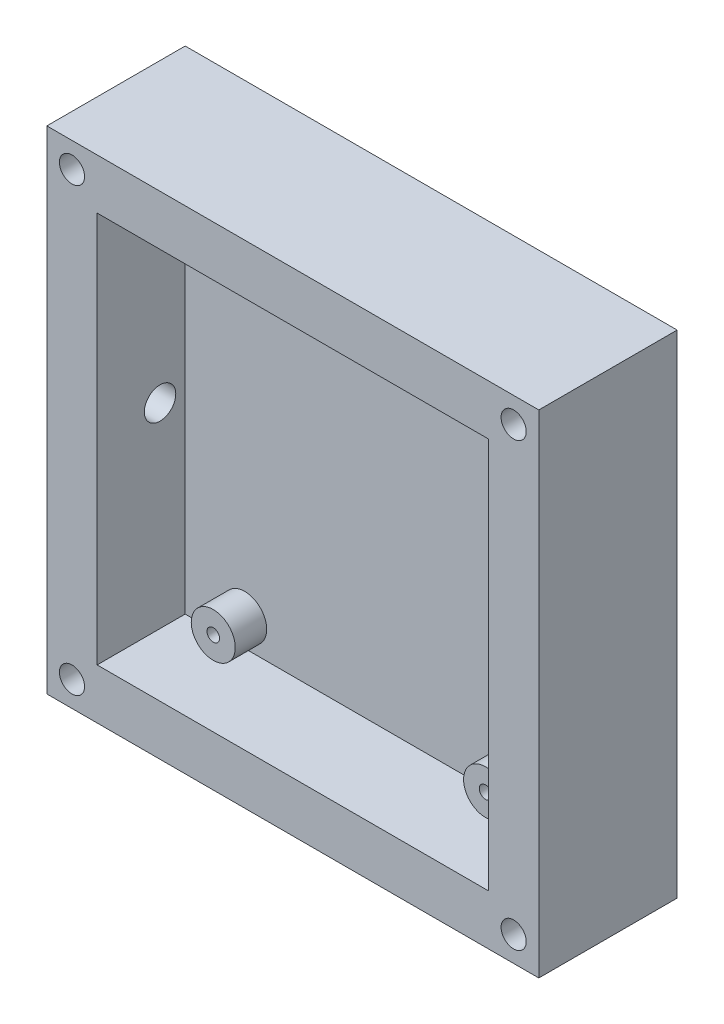
ISO-10303-21;
HEADER;
FILE_DESCRIPTION(('STEP AP214'),'2;1');
FILE_NAME('part.step','',(''),(''),'','','');
FILE_SCHEMA(('AUTOMOTIVE_DESIGN { 1 0 10303 214 1 1 1 1 }'));
ENDSEC;
DATA;
#1=APPLICATION_CONTEXT('core data for automotive mechanical design processes');
#2=APPLICATION_PROTOCOL_DEFINITION('international standard','automotive_design',2000,#1);
#3=PRODUCT_CONTEXT('',#1,'mechanical');
#4=PRODUCT('Part','Part','',(#3));
#5=PRODUCT_RELATED_PRODUCT_CATEGORY('part','',(#4));
#6=PRODUCT_DEFINITION_FORMATION('','',#4);
#7=PRODUCT_DEFINITION_CONTEXT('part definition',#1,'design');
#8=PRODUCT_DEFINITION('design','',#6,#7);
#9=PRODUCT_DEFINITION_SHAPE('','',#8);
#10=(LENGTH_UNIT() NAMED_UNIT(*) SI_UNIT(.MILLI.,.METRE.));
#11=(NAMED_UNIT(*) PLANE_ANGLE_UNIT() SI_UNIT($,.RADIAN.));
#12=(NAMED_UNIT(*) SI_UNIT($,.STERADIAN.) SOLID_ANGLE_UNIT());
#13=UNCERTAINTY_MEASURE_WITH_UNIT(LENGTH_MEASURE(1.E-05),#10,'distance_accuracy_value','');
#14=(GEOMETRIC_REPRESENTATION_CONTEXT(3) GLOBAL_UNCERTAINTY_ASSIGNED_CONTEXT((#13)) GLOBAL_UNIT_ASSIGNED_CONTEXT((#10,
#11,#12)) REPRESENTATION_CONTEXT('',''));
#15=CARTESIAN_POINT('',(0.,0.,0.));
#16=DIRECTION('',(0.,0.,1.));
#17=DIRECTION('',(1.,0.,0.));
#18=AXIS2_PLACEMENT_3D('',#15,#16,#17);
#19=CARTESIAN_POINT('',(39.11,39.11,22.));
#20=DIRECTION('',(-1.,0.,0.));
#21=DIRECTION('',(0.,0.,1.));
#22=AXIS2_PLACEMENT_3D('',#19,#20,#21);
#23=PLANE('',#22);
#24=DIRECTION('',(0.,1.,0.));
#25=VECTOR('',#24,1.);
#26=CARTESIAN_POINT('',(39.11,39.11,0.));
#27=LINE('',#26,#25);
#28=CARTESIAN_POINT('',(39.11,-39.11,0.));
#29=VERTEX_POINT('',#28);
#30=CARTESIAN_POINT('',(39.11,39.11,0.));
#31=VERTEX_POINT('',#30);
#32=EDGE_CURVE('E155',#29,#31,#27,.T.);
#33=ORIENTED_EDGE('',*,*,#32,.T.);
#34=DIRECTION('',(0.,0.,-1.));
#35=VECTOR('',#34,1.);
#36=CARTESIAN_POINT('',(39.11,39.11,22.));
#37=LINE('',#36,#35);
#38=CARTESIAN_POINT('',(39.11,39.11,22.));
#39=VERTEX_POINT('',#38);
#40=EDGE_CURVE('E169',#39,#31,#37,.T.);
#41=ORIENTED_EDGE('',*,*,#40,.F.);
#42=DIRECTION('',(0.,1.,0.));
#43=VECTOR('',#42,1.);
#44=CARTESIAN_POINT('',(39.11,39.11,22.));
#45=LINE('',#44,#43);
#46=CARTESIAN_POINT('',(39.11,-39.11,22.));
#47=VERTEX_POINT('',#46);
#48=EDGE_CURVE('E148',#47,#39,#45,.T.);
#49=ORIENTED_EDGE('',*,*,#48,.F.);
#50=DIRECTION('',(0.,0.,-1.));
#51=VECTOR('',#50,1.);
#52=CARTESIAN_POINT('',(39.11,-39.11,22.));
#53=LINE('',#52,#51);
#54=EDGE_CURVE('E154',#47,#29,#53,.T.);
#55=ORIENTED_EDGE('',*,*,#54,.T.);
#56=EDGE_LOOP('',(#33,#41,#49,#55));
#57=FACE_BOUND('',#56,.T.);
#58=ADVANCED_FACE('F39',(#57),#23,.F.);
#59=CARTESIAN_POINT('',(-39.11,39.11,22.));
#60=DIRECTION('',(0.,-1.,0.));
#61=DIRECTION('',(0.,0.,-1.));
#62=AXIS2_PLACEMENT_3D('',#59,#60,#61);
#63=PLANE('',#62);
#64=DIRECTION('',(-1.,0.,0.));
#65=VECTOR('',#64,1.);
#66=CARTESIAN_POINT('',(-39.11,39.11,0.));
#67=LINE('',#66,#65);
#68=CARTESIAN_POINT('',(-39.11,39.11,0.));
#69=VERTEX_POINT('',#68);
#70=EDGE_CURVE('E158',#31,#69,#67,.T.);
#71=ORIENTED_EDGE('',*,*,#70,.T.);
#72=DIRECTION('',(0.,0.,-1.));
#73=VECTOR('',#72,1.);
#74=CARTESIAN_POINT('',(-39.11,39.11,22.));
#75=LINE('',#74,#73);
#76=CARTESIAN_POINT('',(-39.11,39.11,22.));
#77=VERTEX_POINT('',#76);
#78=EDGE_CURVE('E166',#77,#69,#75,.T.);
#79=ORIENTED_EDGE('',*,*,#78,.F.);
#80=DIRECTION('',(-1.,0.,0.));
#81=VECTOR('',#80,1.);
#82=CARTESIAN_POINT('',(-39.11,39.11,22.));
#83=LINE('',#82,#81);
#84=EDGE_CURVE('E92',#39,#77,#83,.T.);
#85=ORIENTED_EDGE('',*,*,#84,.F.);
#86=ORIENTED_EDGE('',*,*,#40,.T.);
#87=EDGE_LOOP('',(#71,#79,#85,#86));
#88=FACE_BOUND('',#87,.T.);
#89=ADVANCED_FACE('F195',(#88),#63,.F.);
#90=CARTESIAN_POINT('',(-39.11,39.11,22.));
#91=DIRECTION('',(1.,0.,0.));
#92=DIRECTION('',(0.,0.,-1.));
#93=AXIS2_PLACEMENT_3D('',#90,#91,#92);
#94=PLANE('',#93);
#95=CARTESIAN_POINT('',(-39.11,-0.040287358321679,12.));
#96=DIRECTION('',(-1.,0.,0.));
#97=DIRECTION('',(0.,-1.,0.));
#98=AXIS2_PLACEMENT_3D('',#95,#96,#97);
#99=CIRCLE('',#98,2.5);
#100=CARTESIAN_POINT('',(-39.11,-2.54028735832168,12.));
#101=VERTEX_POINT('',#100);
#102=EDGE_CURVE('E232',#101,#101,#99,.T.);
#103=ORIENTED_EDGE('',*,*,#102,.F.);
#104=EDGE_LOOP('',(#103));
#105=FACE_BOUND('',#104,.T.);
#106=DIRECTION('',(0.,-1.,0.));
#107=VECTOR('',#106,1.);
#108=CARTESIAN_POINT('',(-39.11,39.11,0.));
#109=LINE('',#108,#107);
#110=CARTESIAN_POINT('',(-39.11,-39.11,0.));
#111=VERTEX_POINT('',#110);
#112=EDGE_CURVE('E160',#69,#111,#109,.T.);
#113=ORIENTED_EDGE('',*,*,#112,.T.);
#114=DIRECTION('',(0.,0.,-1.));
#115=VECTOR('',#114,1.);
#116=CARTESIAN_POINT('',(-39.11,-39.11,22.));
#117=LINE('',#116,#115);
#118=CARTESIAN_POINT('',(-39.11,-39.11,22.));
#119=VERTEX_POINT('',#118);
#120=EDGE_CURVE('E164',#119,#111,#117,.T.);
#121=ORIENTED_EDGE('',*,*,#120,.F.);
#122=DIRECTION('',(0.,-1.,0.));
#123=VECTOR('',#122,1.);
#124=CARTESIAN_POINT('',(-39.11,39.11,22.));
#125=LINE('',#124,#123);
#126=EDGE_CURVE('E151',#77,#119,#125,.T.);
#127=ORIENTED_EDGE('',*,*,#126,.F.);
#128=ORIENTED_EDGE('',*,*,#78,.T.);
#129=EDGE_LOOP('',(#113,#121,#127,#128));
#130=FACE_BOUND('',#129,.T.);
#131=ADVANCED_FACE('F200',(#105,#130),#94,.F.);
#132=CARTESIAN_POINT('',(-39.11,-39.11,22.));
#133=DIRECTION('',(0.,1.,0.));
#134=DIRECTION('',(0.,0.,1.));
#135=AXIS2_PLACEMENT_3D('',#132,#133,#134);
#136=PLANE('',#135);
#137=DIRECTION('',(1.,0.,0.));
#138=VECTOR('',#137,1.);
#139=CARTESIAN_POINT('',(-39.11,-39.11,0.));
#140=LINE('',#139,#138);
#141=EDGE_CURVE('E84',#111,#29,#140,.T.);
#142=ORIENTED_EDGE('',*,*,#141,.T.);
#143=ORIENTED_EDGE('',*,*,#54,.F.);
#144=DIRECTION('',(1.,0.,0.));
#145=VECTOR('',#144,1.);
#146=CARTESIAN_POINT('',(-39.11,-39.11,22.));
#147=LINE('',#146,#145);
#148=EDGE_CURVE('E63',#119,#47,#147,.T.);
#149=ORIENTED_EDGE('',*,*,#148,.F.);
#150=ORIENTED_EDGE('',*,*,#120,.T.);
#151=EDGE_LOOP('',(#142,#143,#149,#150));
#152=FACE_BOUND('',#151,.T.);
#153=ADVANCED_FACE('F212',(#152),#136,.F.);
#154=CARTESIAN_POINT('',(0.,0.,22.));
#155=DIRECTION('',(0.,0.,1.));
#156=DIRECTION('',(1.,0.,0.));
#157=AXIS2_PLACEMENT_3D('',#154,#155,#156);
#158=PLANE('',#157);
#159=CARTESIAN_POINT('',(-35.11,-35.11,22.));
#160=DIRECTION('',(0.,0.,1.));
#161=DIRECTION('',(-1.,0.,0.));
#162=AXIS2_PLACEMENT_3D('',#159,#160,#161);
#163=CIRCLE('',#162,2.);
#164=CARTESIAN_POINT('',(-37.11,-35.11,22.));
#165=VERTEX_POINT('',#164);
#166=EDGE_CURVE('E293',#165,#165,#163,.T.);
#167=ORIENTED_EDGE('',*,*,#166,.F.);
#168=EDGE_LOOP('',(#167));
#169=FACE_BOUND('',#168,.T.);
#170=CARTESIAN_POINT('',(35.11,35.11,22.));
#171=DIRECTION('',(0.,0.,1.));
#172=DIRECTION('',(1.,0.,0.));
#173=AXIS2_PLACEMENT_3D('',#170,#171,#172);
#174=CIRCLE('',#173,2.);
#175=CARTESIAN_POINT('',(37.11,35.11,22.));
#176=VERTEX_POINT('',#175);
#177=EDGE_CURVE('E287',#176,#176,#174,.T.);
#178=ORIENTED_EDGE('',*,*,#177,.F.);
#179=EDGE_LOOP('',(#178));
#180=FACE_BOUND('',#179,.T.);
#181=CARTESIAN_POINT('',(35.11,-35.11,22.));
#182=DIRECTION('',(0.,0.,1.));
#183=DIRECTION('',(-1.,0.,0.));
#184=AXIS2_PLACEMENT_3D('',#181,#182,#183);
#185=CIRCLE('',#184,2.);
#186=CARTESIAN_POINT('',(33.11,-35.11,22.));
#187=VERTEX_POINT('',#186);
#188=EDGE_CURVE('E280',#187,#187,#185,.T.);
#189=ORIENTED_EDGE('',*,*,#188,.F.);
#190=EDGE_LOOP('',(#189));
#191=FACE_BOUND('',#190,.T.);
#192=CARTESIAN_POINT('',(-35.11,35.11,22.));
#193=DIRECTION('',(0.,0.,1.));
#194=DIRECTION('',(1.,0.,0.));
#195=AXIS2_PLACEMENT_3D('',#192,#193,#194);
#196=CIRCLE('',#195,2.);
#197=CARTESIAN_POINT('',(-33.11,35.11,22.));
#198=VERTEX_POINT('',#197);
#199=EDGE_CURVE('E283',#198,#198,#196,.T.);
#200=ORIENTED_EDGE('',*,*,#199,.F.);
#201=EDGE_LOOP('',(#200));
#202=FACE_BOUND('',#201,.T.);
#203=DIRECTION('',(0.,1.,0.));
#204=VECTOR('',#203,1.);
#205=CARTESIAN_POINT('',(31.11,39.11,22.));
#206=LINE('',#205,#204);
#207=CARTESIAN_POINT('',(31.11,-31.11,22.));
#208=VERTEX_POINT('',#207);
#209=CARTESIAN_POINT('',(31.11,31.11,22.));
#210=VERTEX_POINT('',#209);
#211=EDGE_CURVE('E137',#208,#210,#206,.T.);
#212=ORIENTED_EDGE('',*,*,#211,.F.);
#213=DIRECTION('',(1.,0.,0.));
#214=VECTOR('',#213,1.);
#215=CARTESIAN_POINT('',(-39.11,-31.11,22.));
#216=LINE('',#215,#214);
#217=CARTESIAN_POINT('',(-31.11,-31.11,22.));
#218=VERTEX_POINT('',#217);
#219=EDGE_CURVE('E146',#218,#208,#216,.T.);
#220=ORIENTED_EDGE('',*,*,#219,.F.);
#221=DIRECTION('',(0.,-1.,0.));
#222=VECTOR('',#221,1.);
#223=CARTESIAN_POINT('',(-31.11,39.11,22.));
#224=LINE('',#223,#222);
#225=CARTESIAN_POINT('',(-31.11,31.11,22.));
#226=VERTEX_POINT('',#225);
#227=EDGE_CURVE('E144',#226,#218,#224,.T.);
#228=ORIENTED_EDGE('',*,*,#227,.F.);
#229=DIRECTION('',(-1.,0.,0.));
#230=VECTOR('',#229,1.);
#231=CARTESIAN_POINT('',(-39.11,31.11,22.));
#232=LINE('',#231,#230);
#233=EDGE_CURVE('E129',#210,#226,#232,.T.);
#234=ORIENTED_EDGE('',*,*,#233,.F.);
#235=EDGE_LOOP('',(#212,#220,#228,#234));
#236=FACE_BOUND('',#235,.T.);
#237=ORIENTED_EDGE('',*,*,#48,.T.);
#238=ORIENTED_EDGE('',*,*,#84,.T.);
#239=ORIENTED_EDGE('',*,*,#126,.T.);
#240=ORIENTED_EDGE('',*,*,#148,.T.);
#241=EDGE_LOOP('',(#237,#238,#239,#240));
#242=FACE_BOUND('',#241,.T.);
#243=ADVANCED_FACE('F210',(#169,#180,#191,#202,#236,#242),#158,.T.);
#244=CARTESIAN_POINT('',(0.,0.,0.));
#245=DIRECTION('',(0.,0.,1.));
#246=DIRECTION('',(1.,0.,0.));
#247=AXIS2_PLACEMENT_3D('',#244,#245,#246);
#248=PLANE('',#247);
#249=ORIENTED_EDGE('',*,*,#32,.F.);
#250=ORIENTED_EDGE('',*,*,#141,.F.);
#251=ORIENTED_EDGE('',*,*,#112,.F.);
#252=ORIENTED_EDGE('',*,*,#70,.F.);
#253=EDGE_LOOP('',(#249,#250,#251,#252));
#254=FACE_BOUND('',#253,.T.);
#255=ADVANCED_FACE('F205',(#254),#248,.F.);
#256=CARTESIAN_POINT('',(31.11,39.11,22.));
#257=DIRECTION('',(-1.,0.,0.));
#258=DIRECTION('',(0.,0.,1.));
#259=AXIS2_PLACEMENT_3D('',#256,#257,#258);
#260=PLANE('',#259);
#261=DIRECTION('',(0.,1.,0.));
#262=VECTOR('',#261,1.);
#263=CARTESIAN_POINT('',(31.11,39.11,8.));
#264=LINE('',#263,#262);
#265=CARTESIAN_POINT('',(31.11,-31.11,8.));
#266=VERTEX_POINT('',#265);
#267=CARTESIAN_POINT('',(31.11,31.11,8.));
#268=VERTEX_POINT('',#267);
#269=EDGE_CURVE('E120',#266,#268,#264,.T.);
#270=ORIENTED_EDGE('',*,*,#269,.F.);
#271=DIRECTION('',(0.,0.,-1.));
#272=VECTOR('',#271,1.);
#273=CARTESIAN_POINT('',(31.11,-31.11,22.));
#274=LINE('',#273,#272);
#275=EDGE_CURVE('E140',#208,#266,#274,.T.);
#276=ORIENTED_EDGE('',*,*,#275,.F.);
#277=ORIENTED_EDGE('',*,*,#211,.T.);
#278=DIRECTION('',(0.,0.,-1.));
#279=VECTOR('',#278,1.);
#280=CARTESIAN_POINT('',(31.11,31.11,22.));
#281=LINE('',#280,#279);
#282=EDGE_CURVE('E132',#210,#268,#281,.T.);
#283=ORIENTED_EDGE('',*,*,#282,.T.);
#284=EDGE_LOOP('',(#270,#276,#277,#283));
#285=FACE_BOUND('',#284,.T.);
#286=ADVANCED_FACE('F217',(#285),#260,.T.);
#287=CARTESIAN_POINT('',(-39.11,31.11,22.));
#288=DIRECTION('',(0.,-1.,0.));
#289=DIRECTION('',(0.,0.,-1.));
#290=AXIS2_PLACEMENT_3D('',#287,#288,#289);
#291=PLANE('',#290);
#292=DIRECTION('',(-1.,0.,0.));
#293=VECTOR('',#292,1.);
#294=CARTESIAN_POINT('',(-39.11,31.11,8.));
#295=LINE('',#294,#293);
#296=CARTESIAN_POINT('',(-31.11,31.11,8.));
#297=VERTEX_POINT('',#296);
#298=EDGE_CURVE('E114',#268,#297,#295,.T.);
#299=ORIENTED_EDGE('',*,*,#298,.F.);
#300=ORIENTED_EDGE('',*,*,#282,.F.);
#301=ORIENTED_EDGE('',*,*,#233,.T.);
#302=DIRECTION('',(0.,0.,-1.));
#303=VECTOR('',#302,1.);
#304=CARTESIAN_POINT('',(-31.11,31.11,22.));
#305=LINE('',#304,#303);
#306=EDGE_CURVE('E126',#226,#297,#305,.T.);
#307=ORIENTED_EDGE('',*,*,#306,.T.);
#308=EDGE_LOOP('',(#299,#300,#301,#307));
#309=FACE_BOUND('',#308,.T.);
#310=ADVANCED_FACE('F127',(#309),#291,.T.);
#311=CARTESIAN_POINT('',(-31.11,39.11,22.));
#312=DIRECTION('',(1.,0.,0.));
#313=DIRECTION('',(0.,0.,-1.));
#314=AXIS2_PLACEMENT_3D('',#311,#312,#313);
#315=PLANE('',#314);
#316=CARTESIAN_POINT('',(-31.11,-0.0402873583216776,12.));
#317=DIRECTION('',(1.,0.,0.));
#318=DIRECTION('',(0.,0.,-1.));
#319=AXIS2_PLACEMENT_3D('',#316,#317,#318);
#320=CIRCLE('',#319,2.5);
#321=CARTESIAN_POINT('',(-31.11,-0.0402873583216776,9.5));
#322=VERTEX_POINT('',#321);
#323=EDGE_CURVE('E42',#322,#322,#320,.T.);
#324=ORIENTED_EDGE('',*,*,#323,.F.);
#325=EDGE_LOOP('',(#324));
#326=FACE_BOUND('',#325,.T.);
#327=DIRECTION('',(0.,-1.,0.));
#328=VECTOR('',#327,1.);
#329=CARTESIAN_POINT('',(-31.11,39.11,8.));
#330=LINE('',#329,#328);
#331=CARTESIAN_POINT('',(-31.11,-31.11,8.));
#332=VERTEX_POINT('',#331);
#333=EDGE_CURVE('E118',#297,#332,#330,.T.);
#334=ORIENTED_EDGE('',*,*,#333,.F.);
#335=ORIENTED_EDGE('',*,*,#306,.F.);
#336=ORIENTED_EDGE('',*,*,#227,.T.);
#337=DIRECTION('',(0.,0.,-1.));
#338=VECTOR('',#337,1.);
#339=CARTESIAN_POINT('',(-31.11,-31.11,22.));
#340=LINE('',#339,#338);
#341=EDGE_CURVE('E54',#218,#332,#340,.T.);
#342=ORIENTED_EDGE('',*,*,#341,.T.);
#343=EDGE_LOOP('',(#334,#335,#336,#342));
#344=FACE_BOUND('',#343,.T.);
#345=ADVANCED_FACE('F134',(#326,#344),#315,.T.);
#346=CARTESIAN_POINT('',(-39.11,-31.11,22.));
#347=DIRECTION('',(0.,1.,0.));
#348=DIRECTION('',(0.,0.,1.));
#349=AXIS2_PLACEMENT_3D('',#346,#347,#348);
#350=PLANE('',#349);
#351=DIRECTION('',(1.,0.,0.));
#352=VECTOR('',#351,1.);
#353=CARTESIAN_POINT('',(-39.11,-31.11,8.));
#354=LINE('',#353,#352);
#355=EDGE_CURVE('E135',#332,#266,#354,.T.);
#356=ORIENTED_EDGE('',*,*,#355,.F.);
#357=ORIENTED_EDGE('',*,*,#341,.F.);
#358=ORIENTED_EDGE('',*,*,#219,.T.);
#359=ORIENTED_EDGE('',*,*,#275,.T.);
#360=EDGE_LOOP('',(#356,#357,#358,#359));
#361=FACE_BOUND('',#360,.T.);
#362=ADVANCED_FACE('F178',(#361),#350,.T.);
#363=CARTESIAN_POINT('',(0.,0.,8.));
#364=DIRECTION('',(0.,0.,1.));
#365=DIRECTION('',(1.,0.,0.));
#366=AXIS2_PLACEMENT_3D('',#363,#364,#365);
#367=PLANE('',#366);
#368=CARTESIAN_POINT('',(-21.65,26.75,8.));
#369=DIRECTION('',(0.,0.,1.));
#370=DIRECTION('',(1.,0.,0.));
#371=AXIS2_PLACEMENT_3D('',#368,#369,#370);
#372=CIRCLE('',#371,3.5);
#373=CARTESIAN_POINT('',(-18.15,26.75,8.));
#374=VERTEX_POINT('',#373);
#375=EDGE_CURVE('E262',#374,#374,#372,.T.);
#376=ORIENTED_EDGE('',*,*,#375,.F.);
#377=EDGE_LOOP('',(#376));
#378=FACE_BOUND('',#377,.T.);
#379=CARTESIAN_POINT('',(-21.65,-26.75,8.));
#380=DIRECTION('',(0.,0.,1.));
#381=DIRECTION('',(1.,0.,0.));
#382=AXIS2_PLACEMENT_3D('',#379,#380,#381);
#383=CIRCLE('',#382,3.5);
#384=CARTESIAN_POINT('',(-18.15,-26.75,8.));
#385=VERTEX_POINT('',#384);
#386=EDGE_CURVE('E11',#385,#385,#383,.T.);
#387=ORIENTED_EDGE('',*,*,#386,.F.);
#388=EDGE_LOOP('',(#387));
#389=FACE_BOUND('',#388,.T.);
#390=CARTESIAN_POINT('',(21.65,-26.75,8.));
#391=DIRECTION('',(0.,0.,1.));
#392=DIRECTION('',(1.,0.,0.));
#393=AXIS2_PLACEMENT_3D('',#390,#391,#392);
#394=CIRCLE('',#393,3.5);
#395=CARTESIAN_POINT('',(25.15,-26.75,8.));
#396=VERTEX_POINT('',#395);
#397=EDGE_CURVE('E271',#396,#396,#394,.T.);
#398=ORIENTED_EDGE('',*,*,#397,.F.);
#399=EDGE_LOOP('',(#398));
#400=FACE_BOUND('',#399,.T.);
#401=CARTESIAN_POINT('',(21.65,26.75,8.));
#402=DIRECTION('',(0.,0.,1.));
#403=DIRECTION('',(1.,0.,0.));
#404=AXIS2_PLACEMENT_3D('',#401,#402,#403);
#405=CIRCLE('',#404,3.5);
#406=CARTESIAN_POINT('',(25.15,26.75,8.));
#407=VERTEX_POINT('',#406);
#408=EDGE_CURVE('E47',#407,#407,#405,.T.);
#409=ORIENTED_EDGE('',*,*,#408,.F.);
#410=EDGE_LOOP('',(#409));
#411=FACE_BOUND('',#410,.T.);
#412=ORIENTED_EDGE('',*,*,#269,.T.);
#413=ORIENTED_EDGE('',*,*,#298,.T.);
#414=ORIENTED_EDGE('',*,*,#333,.T.);
#415=ORIENTED_EDGE('',*,*,#355,.T.);
#416=EDGE_LOOP('',(#412,#413,#414,#415));
#417=FACE_BOUND('',#416,.T.);
#418=ADVANCED_FACE('F116',(#378,#389,#400,#411,#417),#367,.T.);
#419=CARTESIAN_POINT('',(-35.11,35.11,8.));
#420=DIRECTION('',(0.,0.,1.));
#421=DIRECTION('',(1.,0.,0.));
#422=AXIS2_PLACEMENT_3D('',#419,#420,#421);
#423=CYLINDRICAL_SURFACE('',#422,2.);
#424=CARTESIAN_POINT('',(-35.11,35.11,8.));
#425=DIRECTION('',(0.,0.,1.));
#426=DIRECTION('',(1.,0.,0.));
#427=AXIS2_PLACEMENT_3D('',#424,#425,#426);
#428=CIRCLE('',#427,2.);
#429=CARTESIAN_POINT('',(-33.11,35.11,8.));
#430=VERTEX_POINT('',#429);
#431=EDGE_CURVE('E298',#430,#430,#428,.T.);
#432=ORIENTED_EDGE('',*,*,#431,.F.);
#433=EDGE_LOOP('',(#432));
#434=FACE_BOUND('',#433,.T.);
#435=ORIENTED_EDGE('',*,*,#199,.T.);
#436=EDGE_LOOP('',(#435));
#437=FACE_BOUND('',#436,.T.);
#438=ADVANCED_FACE('F177',(#434,#437),#423,.F.);
#439=CARTESIAN_POINT('',(-35.11,35.11,8.));
#440=DIRECTION('',(0.,0.,1.));
#441=DIRECTION('',(1.,0.,0.));
#442=AXIS2_PLACEMENT_3D('',#439,#440,#441);
#443=PLANE('',#442);
#444=ORIENTED_EDGE('',*,*,#431,.T.);
#445=EDGE_LOOP('',(#444));
#446=FACE_BOUND('',#445,.T.);
#447=ADVANCED_FACE('F186',(#446),#443,.T.);
#448=CARTESIAN_POINT('',(35.11,-35.11,8.));
#449=DIRECTION('',(0.,0.,1.));
#450=DIRECTION('',(1.,0.,0.));
#451=AXIS2_PLACEMENT_3D('',#448,#449,#450);
#452=CYLINDRICAL_SURFACE('',#451,2.);
#453=CARTESIAN_POINT('',(35.11,-35.11,8.));
#454=DIRECTION('',(0.,0.,1.));
#455=DIRECTION('',(-1.,0.,0.));
#456=AXIS2_PLACEMENT_3D('',#453,#454,#455);
#457=CIRCLE('',#456,2.);
#458=CARTESIAN_POINT('',(33.11,-35.11,8.));
#459=VERTEX_POINT('',#458);
#460=EDGE_CURVE('E284',#459,#459,#457,.T.);
#461=ORIENTED_EDGE('',*,*,#460,.F.);
#462=EDGE_LOOP('',(#461));
#463=FACE_BOUND('',#462,.T.);
#464=ORIENTED_EDGE('',*,*,#188,.T.);
#465=EDGE_LOOP('',(#464));
#466=FACE_BOUND('',#465,.T.);
#467=ADVANCED_FACE('F392',(#463,#466),#452,.F.);
#468=CARTESIAN_POINT('',(35.11,-35.11,8.));
#469=DIRECTION('',(0.,0.,-1.));
#470=DIRECTION('',(-1.,0.,0.));
#471=AXIS2_PLACEMENT_3D('',#468,#469,#470);
#472=PLANE('',#471);
#473=ORIENTED_EDGE('',*,*,#460,.T.);
#474=EDGE_LOOP('',(#473));
#475=FACE_BOUND('',#474,.T.);
#476=ADVANCED_FACE('F395',(#475),#472,.F.);
#477=CARTESIAN_POINT('',(35.11,35.11,8.));
#478=DIRECTION('',(0.,0.,1.));
#479=DIRECTION('',(1.,0.,0.));
#480=AXIS2_PLACEMENT_3D('',#477,#478,#479);
#481=CYLINDRICAL_SURFACE('',#480,2.);
#482=CARTESIAN_POINT('',(35.11,35.11,8.));
#483=DIRECTION('',(0.,0.,1.));
#484=DIRECTION('',(1.,0.,0.));
#485=AXIS2_PLACEMENT_3D('',#482,#483,#484);
#486=CIRCLE('',#485,2.);
#487=CARTESIAN_POINT('',(37.11,35.11,8.));
#488=VERTEX_POINT('',#487);
#489=EDGE_CURVE('E290',#488,#488,#486,.T.);
#490=ORIENTED_EDGE('',*,*,#489,.F.);
#491=EDGE_LOOP('',(#490));
#492=FACE_BOUND('',#491,.T.);
#493=ORIENTED_EDGE('',*,*,#177,.T.);
#494=EDGE_LOOP('',(#493));
#495=FACE_BOUND('',#494,.T.);
#496=ADVANCED_FACE('F399',(#492,#495),#481,.F.);
#497=CARTESIAN_POINT('',(35.11,35.11,8.));
#498=DIRECTION('',(0.,0.,1.));
#499=DIRECTION('',(1.,0.,0.));
#500=AXIS2_PLACEMENT_3D('',#497,#498,#499);
#501=PLANE('',#500);
#502=ORIENTED_EDGE('',*,*,#489,.T.);
#503=EDGE_LOOP('',(#502));
#504=FACE_BOUND('',#503,.T.);
#505=ADVANCED_FACE('F403',(#504),#501,.T.);
#506=CARTESIAN_POINT('',(-35.11,-35.11,8.));
#507=DIRECTION('',(0.,0.,1.));
#508=DIRECTION('',(1.,0.,0.));
#509=AXIS2_PLACEMENT_3D('',#506,#507,#508);
#510=CYLINDRICAL_SURFACE('',#509,2.);
#511=CARTESIAN_POINT('',(-35.11,-35.11,8.));
#512=DIRECTION('',(0.,0.,1.));
#513=DIRECTION('',(-1.,0.,0.));
#514=AXIS2_PLACEMENT_3D('',#511,#512,#513);
#515=CIRCLE('',#514,2.);
#516=CARTESIAN_POINT('',(-37.11,-35.11,8.));
#517=VERTEX_POINT('',#516);
#518=EDGE_CURVE('E279',#517,#517,#515,.T.);
#519=ORIENTED_EDGE('',*,*,#518,.F.);
#520=EDGE_LOOP('',(#519));
#521=FACE_BOUND('',#520,.T.);
#522=ORIENTED_EDGE('',*,*,#166,.T.);
#523=EDGE_LOOP('',(#522));
#524=FACE_BOUND('',#523,.T.);
#525=ADVANCED_FACE('F407',(#521,#524),#510,.F.);
#526=CARTESIAN_POINT('',(-35.11,-35.11,8.));
#527=DIRECTION('',(0.,0.,-1.));
#528=DIRECTION('',(-1.,0.,0.));
#529=AXIS2_PLACEMENT_3D('',#526,#527,#528);
#530=PLANE('',#529);
#531=ORIENTED_EDGE('',*,*,#518,.T.);
#532=EDGE_LOOP('',(#531));
#533=FACE_BOUND('',#532,.T.);
#534=ADVANCED_FACE('F390',(#533),#530,.F.);
#535=CARTESIAN_POINT('',(21.65,26.75,13.));
#536=DIRECTION('',(0.,0.,-1.));
#537=DIRECTION('',(-1.,0.,0.));
#538=AXIS2_PLACEMENT_3D('',#535,#536,#537);
#539=CYLINDRICAL_SURFACE('',#538,3.5);
#540=CARTESIAN_POINT('',(21.65,26.75,13.));
#541=DIRECTION('',(0.,0.,-1.));
#542=DIRECTION('',(-1.,0.,0.));
#543=AXIS2_PLACEMENT_3D('',#540,#541,#542);
#544=CIRCLE('',#543,3.5);
#545=CARTESIAN_POINT('',(18.15,26.75,13.));
#546=VERTEX_POINT('',#545);
#547=EDGE_CURVE('E274',#546,#546,#544,.T.);
#548=ORIENTED_EDGE('',*,*,#547,.T.);
#549=EDGE_LOOP('',(#548));
#550=FACE_BOUND('',#549,.T.);
#551=ORIENTED_EDGE('',*,*,#408,.T.);
#552=EDGE_LOOP('',(#551));
#553=FACE_BOUND('',#552,.T.);
#554=ADVANCED_FACE('F174',(#550,#553),#539,.T.);
#555=CARTESIAN_POINT('',(21.65,26.75,13.));
#556=DIRECTION('',(0.,0.,-1.));
#557=DIRECTION('',(-1.,0.,0.));
#558=AXIS2_PLACEMENT_3D('',#555,#556,#557);
#559=PLANE('',#558);
#560=CARTESIAN_POINT('',(21.65,26.75,13.));
#561=DIRECTION('',(0.,0.,-1.));
#562=DIRECTION('',(-1.,0.,0.));
#563=AXIS2_PLACEMENT_3D('',#560,#561,#562);
#564=CIRCLE('',#563,1.);
#565=CARTESIAN_POINT('',(20.65,26.75,13.));
#566=VERTEX_POINT('',#565);
#567=EDGE_CURVE('E236',#566,#566,#564,.T.);
#568=ORIENTED_EDGE('',*,*,#567,.T.);
#569=EDGE_LOOP('',(#568));
#570=FACE_BOUND('',#569,.T.);
#571=ORIENTED_EDGE('',*,*,#547,.F.);
#572=EDGE_LOOP('',(#571));
#573=FACE_BOUND('',#572,.T.);
#574=ADVANCED_FACE('F381',(#570,#573),#559,.F.);
#575=CARTESIAN_POINT('',(21.65,-26.75,13.));
#576=DIRECTION('',(0.,0.,-1.));
#577=DIRECTION('',(-1.,0.,0.));
#578=AXIS2_PLACEMENT_3D('',#575,#576,#577);
#579=CYLINDRICAL_SURFACE('',#578,3.5);
#580=CARTESIAN_POINT('',(21.65,-26.75,13.));
#581=DIRECTION('',(0.,0.,1.));
#582=DIRECTION('',(1.,0.,0.));
#583=AXIS2_PLACEMENT_3D('',#580,#581,#582);
#584=CIRCLE('',#583,3.5);
#585=CARTESIAN_POINT('',(25.15,-26.75,13.));
#586=VERTEX_POINT('',#585);
#587=EDGE_CURVE('E270',#586,#586,#584,.T.);
#588=ORIENTED_EDGE('',*,*,#587,.F.);
#589=EDGE_LOOP('',(#588));
#590=FACE_BOUND('',#589,.T.);
#591=ORIENTED_EDGE('',*,*,#397,.T.);
#592=EDGE_LOOP('',(#591));
#593=FACE_BOUND('',#592,.T.);
#594=ADVANCED_FACE('F378',(#590,#593),#579,.T.);
#595=CARTESIAN_POINT('',(21.65,-26.75,13.));
#596=DIRECTION('',(0.,0.,1.));
#597=DIRECTION('',(1.,0.,0.));
#598=AXIS2_PLACEMENT_3D('',#595,#596,#597);
#599=PLANE('',#598);
#600=CARTESIAN_POINT('',(21.65,-26.75,13.));
#601=DIRECTION('',(0.,0.,1.));
#602=DIRECTION('',(1.,0.,0.));
#603=AXIS2_PLACEMENT_3D('',#600,#601,#602);
#604=CIRCLE('',#603,1.);
#605=CARTESIAN_POINT('',(22.65,-26.75,13.));
#606=VERTEX_POINT('',#605);
#607=EDGE_CURVE('E241',#606,#606,#604,.T.);
#608=ORIENTED_EDGE('',*,*,#607,.F.);
#609=EDGE_LOOP('',(#608));
#610=FACE_BOUND('',#609,.T.);
#611=ORIENTED_EDGE('',*,*,#587,.T.);
#612=EDGE_LOOP('',(#611));
#613=FACE_BOUND('',#612,.T.);
#614=ADVANCED_FACE('F373',(#610,#613),#599,.T.);
#615=CARTESIAN_POINT('',(-21.65,-26.75,13.));
#616=DIRECTION('',(0.,0.,-1.));
#617=DIRECTION('',(-1.,0.,0.));
#618=AXIS2_PLACEMENT_3D('',#615,#616,#617);
#619=CYLINDRICAL_SURFACE('',#618,3.5);
#620=CARTESIAN_POINT('',(-21.65,-26.75,13.));
#621=DIRECTION('',(0.,0.,-1.));
#622=DIRECTION('',(-1.,0.,0.));
#623=AXIS2_PLACEMENT_3D('',#620,#621,#622);
#624=CIRCLE('',#623,3.5);
#625=CARTESIAN_POINT('',(-25.15,-26.75,13.));
#626=VERTEX_POINT('',#625);
#627=EDGE_CURVE('E265',#626,#626,#624,.T.);
#628=ORIENTED_EDGE('',*,*,#627,.T.);
#629=EDGE_LOOP('',(#628));
#630=FACE_BOUND('',#629,.T.);
#631=ORIENTED_EDGE('',*,*,#386,.T.);
#632=EDGE_LOOP('',(#631));
#633=FACE_BOUND('',#632,.T.);
#634=ADVANCED_FACE('F370',(#630,#633),#619,.T.);
#635=CARTESIAN_POINT('',(-21.65,-26.75,13.));
#636=DIRECTION('',(0.,0.,-1.));
#637=DIRECTION('',(-1.,0.,0.));
#638=AXIS2_PLACEMENT_3D('',#635,#636,#637);
#639=PLANE('',#638);
#640=CARTESIAN_POINT('',(-21.65,-26.75,13.));
#641=DIRECTION('',(0.,0.,-1.));
#642=DIRECTION('',(-1.,0.,0.));
#643=AXIS2_PLACEMENT_3D('',#640,#641,#642);
#644=CIRCLE('',#643,1.);
#645=CARTESIAN_POINT('',(-22.65,-26.75,13.));
#646=VERTEX_POINT('',#645);
#647=EDGE_CURVE('E256',#646,#646,#644,.T.);
#648=ORIENTED_EDGE('',*,*,#647,.T.);
#649=EDGE_LOOP('',(#648));
#650=FACE_BOUND('',#649,.T.);
#651=ORIENTED_EDGE('',*,*,#627,.F.);
#652=EDGE_LOOP('',(#651));
#653=FACE_BOUND('',#652,.T.);
#654=ADVANCED_FACE('F365',(#650,#653),#639,.F.);
#655=CARTESIAN_POINT('',(-21.65,26.75,13.));
#656=DIRECTION('',(0.,0.,-1.));
#657=DIRECTION('',(-1.,0.,0.));
#658=AXIS2_PLACEMENT_3D('',#655,#656,#657);
#659=CYLINDRICAL_SURFACE('',#658,3.5);
#660=CARTESIAN_POINT('',(-21.65,26.75,13.));
#661=DIRECTION('',(0.,0.,1.));
#662=DIRECTION('',(1.,0.,0.));
#663=AXIS2_PLACEMENT_3D('',#660,#661,#662);
#664=CIRCLE('',#663,3.5);
#665=CARTESIAN_POINT('',(-18.15,26.75,13.));
#666=VERTEX_POINT('',#665);
#667=EDGE_CURVE('E259',#666,#666,#664,.T.);
#668=ORIENTED_EDGE('',*,*,#667,.F.);
#669=EDGE_LOOP('',(#668));
#670=FACE_BOUND('',#669,.T.);
#671=ORIENTED_EDGE('',*,*,#375,.T.);
#672=EDGE_LOOP('',(#671));
#673=FACE_BOUND('',#672,.T.);
#674=ADVANCED_FACE('F362',(#670,#673),#659,.T.);
#675=CARTESIAN_POINT('',(-21.65,26.75,13.));
#676=DIRECTION('',(0.,0.,1.));
#677=DIRECTION('',(1.,0.,0.));
#678=AXIS2_PLACEMENT_3D('',#675,#676,#677);
#679=PLANE('',#678);
#680=CARTESIAN_POINT('',(-21.65,26.75,13.));
#681=DIRECTION('',(0.,0.,1.));
#682=DIRECTION('',(1.,0.,0.));
#683=AXIS2_PLACEMENT_3D('',#680,#681,#682);
#684=CIRCLE('',#683,1.);
#685=CARTESIAN_POINT('',(-20.65,26.75,13.));
#686=VERTEX_POINT('',#685);
#687=EDGE_CURVE('E248',#686,#686,#684,.T.);
#688=ORIENTED_EDGE('',*,*,#687,.F.);
#689=EDGE_LOOP('',(#688));
#690=FACE_BOUND('',#689,.T.);
#691=ORIENTED_EDGE('',*,*,#667,.T.);
#692=EDGE_LOOP('',(#691));
#693=FACE_BOUND('',#692,.T.);
#694=ADVANCED_FACE('F342',(#690,#693),#679,.T.);
#695=CARTESIAN_POINT('',(-21.65,26.75,13.));
#696=DIRECTION('',(0.,0.,-1.));
#697=DIRECTION('',(-1.,0.,0.));
#698=AXIS2_PLACEMENT_3D('',#695,#696,#697);
#699=CYLINDRICAL_SURFACE('',#698,1.);
#700=ORIENTED_EDGE('',*,*,#687,.T.);
#701=EDGE_LOOP('',(#700));
#702=FACE_BOUND('',#701,.T.);
#703=CARTESIAN_POINT('',(-21.65,26.75,8.));
#704=DIRECTION('',(0.,0.,1.));
#705=DIRECTION('',(1.,0.,0.));
#706=AXIS2_PLACEMENT_3D('',#703,#704,#705);
#707=CIRCLE('',#706,1.);
#708=CARTESIAN_POINT('',(-20.65,26.75,8.));
#709=VERTEX_POINT('',#708);
#710=EDGE_CURVE('E244',#709,#709,#707,.T.);
#711=ORIENTED_EDGE('',*,*,#710,.F.);
#712=EDGE_LOOP('',(#711));
#713=FACE_BOUND('',#712,.T.);
#714=ADVANCED_FACE('F338',(#702,#713),#699,.F.);
#715=CARTESIAN_POINT('',(-21.65,26.75,8.));
#716=DIRECTION('',(0.,0.,1.));
#717=DIRECTION('',(1.,0.,0.));
#718=AXIS2_PLACEMENT_3D('',#715,#716,#717);
#719=PLANE('',#718);
#720=ORIENTED_EDGE('',*,*,#710,.T.);
#721=EDGE_LOOP('',(#720));
#722=FACE_BOUND('',#721,.T.);
#723=ADVANCED_FACE('F341',(#722),#719,.T.);
#724=CARTESIAN_POINT('',(-21.65,-26.75,13.));
#725=DIRECTION('',(0.,0.,-1.));
#726=DIRECTION('',(-1.,0.,0.));
#727=AXIS2_PLACEMENT_3D('',#724,#725,#726);
#728=CYLINDRICAL_SURFACE('',#727,1.);
#729=ORIENTED_EDGE('',*,*,#647,.F.);
#730=EDGE_LOOP('',(#729));
#731=FACE_BOUND('',#730,.T.);
#732=CARTESIAN_POINT('',(-21.65,-26.75,8.));
#733=DIRECTION('',(0.,0.,-1.));
#734=DIRECTION('',(-1.,0.,0.));
#735=AXIS2_PLACEMENT_3D('',#732,#733,#734);
#736=CIRCLE('',#735,1.);
#737=CARTESIAN_POINT('',(-22.65,-26.75,8.));
#738=VERTEX_POINT('',#737);
#739=EDGE_CURVE('E247',#738,#738,#736,.T.);
#740=ORIENTED_EDGE('',*,*,#739,.T.);
#741=EDGE_LOOP('',(#740));
#742=FACE_BOUND('',#741,.T.);
#743=ADVANCED_FACE('F346',(#731,#742),#728,.F.);
#744=CARTESIAN_POINT('',(-21.65,-26.75,8.));
#745=DIRECTION('',(0.,0.,-1.));
#746=DIRECTION('',(-1.,0.,0.));
#747=AXIS2_PLACEMENT_3D('',#744,#745,#746);
#748=PLANE('',#747);
#749=ORIENTED_EDGE('',*,*,#739,.F.);
#750=EDGE_LOOP('',(#749));
#751=FACE_BOUND('',#750,.T.);
#752=ADVANCED_FACE('F351',(#751),#748,.F.);
#753=CARTESIAN_POINT('',(21.65,-26.75,13.));
#754=DIRECTION('',(0.,0.,-1.));
#755=DIRECTION('',(-1.,0.,0.));
#756=AXIS2_PLACEMENT_3D('',#753,#754,#755);
#757=CYLINDRICAL_SURFACE('',#756,1.);
#758=ORIENTED_EDGE('',*,*,#607,.T.);
#759=EDGE_LOOP('',(#758));
#760=FACE_BOUND('',#759,.T.);
#761=CARTESIAN_POINT('',(21.65,-26.75,8.));
#762=DIRECTION('',(0.,0.,1.));
#763=DIRECTION('',(1.,0.,0.));
#764=AXIS2_PLACEMENT_3D('',#761,#762,#763);
#765=CIRCLE('',#764,1.);
#766=CARTESIAN_POINT('',(22.65,-26.75,8.));
#767=VERTEX_POINT('',#766);
#768=EDGE_CURVE('E251',#767,#767,#765,.T.);
#769=ORIENTED_EDGE('',*,*,#768,.F.);
#770=EDGE_LOOP('',(#769));
#771=FACE_BOUND('',#770,.T.);
#772=ADVANCED_FACE('F348',(#760,#771),#757,.F.);
#773=CARTESIAN_POINT('',(21.65,-26.75,8.));
#774=DIRECTION('',(0.,0.,1.));
#775=DIRECTION('',(1.,0.,0.));
#776=AXIS2_PLACEMENT_3D('',#773,#774,#775);
#777=PLANE('',#776);
#778=ORIENTED_EDGE('',*,*,#768,.T.);
#779=EDGE_LOOP('',(#778));
#780=FACE_BOUND('',#779,.T.);
#781=ADVANCED_FACE('F335',(#780),#777,.T.);
#782=CARTESIAN_POINT('',(21.65,26.75,13.));
#783=DIRECTION('',(0.,0.,-1.));
#784=DIRECTION('',(-1.,0.,0.));
#785=AXIS2_PLACEMENT_3D('',#782,#783,#784);
#786=CYLINDRICAL_SURFACE('',#785,1.);
#787=ORIENTED_EDGE('',*,*,#567,.F.);
#788=EDGE_LOOP('',(#787));
#789=FACE_BOUND('',#788,.T.);
#790=CARTESIAN_POINT('',(21.65,26.75,8.));
#791=DIRECTION('',(0.,0.,-1.));
#792=DIRECTION('',(-1.,0.,0.));
#793=AXIS2_PLACEMENT_3D('',#790,#791,#792);
#794=CIRCLE('',#793,1.);
#795=CARTESIAN_POINT('',(20.65,26.75,8.));
#796=VERTEX_POINT('',#795);
#797=EDGE_CURVE('E238',#796,#796,#794,.T.);
#798=ORIENTED_EDGE('',*,*,#797,.T.);
#799=EDGE_LOOP('',(#798));
#800=FACE_BOUND('',#799,.T.);
#801=ADVANCED_FACE('F330',(#789,#800),#786,.F.);
#802=CARTESIAN_POINT('',(21.65,26.75,8.));
#803=DIRECTION('',(0.,0.,-1.));
#804=DIRECTION('',(-1.,0.,0.));
#805=AXIS2_PLACEMENT_3D('',#802,#803,#804);
#806=PLANE('',#805);
#807=ORIENTED_EDGE('',*,*,#797,.F.);
#808=EDGE_LOOP('',(#807));
#809=FACE_BOUND('',#808,.T.);
#810=ADVANCED_FACE('F326',(#809),#806,.F.);
#811=CARTESIAN_POINT('',(-27.11,-0.0402873583216769,12.));
#812=DIRECTION('',(-1.,0.,0.));
#813=DIRECTION('',(0.,-1.,0.));
#814=AXIS2_PLACEMENT_3D('',#811,#812,#813);
#815=CYLINDRICAL_SURFACE('',#814,2.5);
#816=ORIENTED_EDGE('',*,*,#323,.T.);
#817=EDGE_LOOP('',(#816));
#818=FACE_BOUND('',#817,.T.);
#819=ORIENTED_EDGE('',*,*,#102,.T.);
#820=EDGE_LOOP('',(#819));
#821=FACE_BOUND('',#820,.T.);
#822=ADVANCED_FACE('F325',(#818,#821),#815,.F.);
#823=CLOSED_SHELL('',(#58,#89,#131,#153,#243,#255,#286,#310,#345,#362,#418,#438,#447,#467,#476,
#496,#505,#525,#534,#554,#574,#594,#614,#634,#654,#674,#694,#714,#723,#743,#752,#772,#781,#801,
#810,#822));
#824=MANIFOLD_SOLID_BREP('B2',#823);
#825=ADVANCED_BREP_SHAPE_REPRESENTATION('',(#18,#824),#14);
#826=SHAPE_DEFINITION_REPRESENTATION(#9,#825);
ENDSEC;
END-ISO-10303-21;
